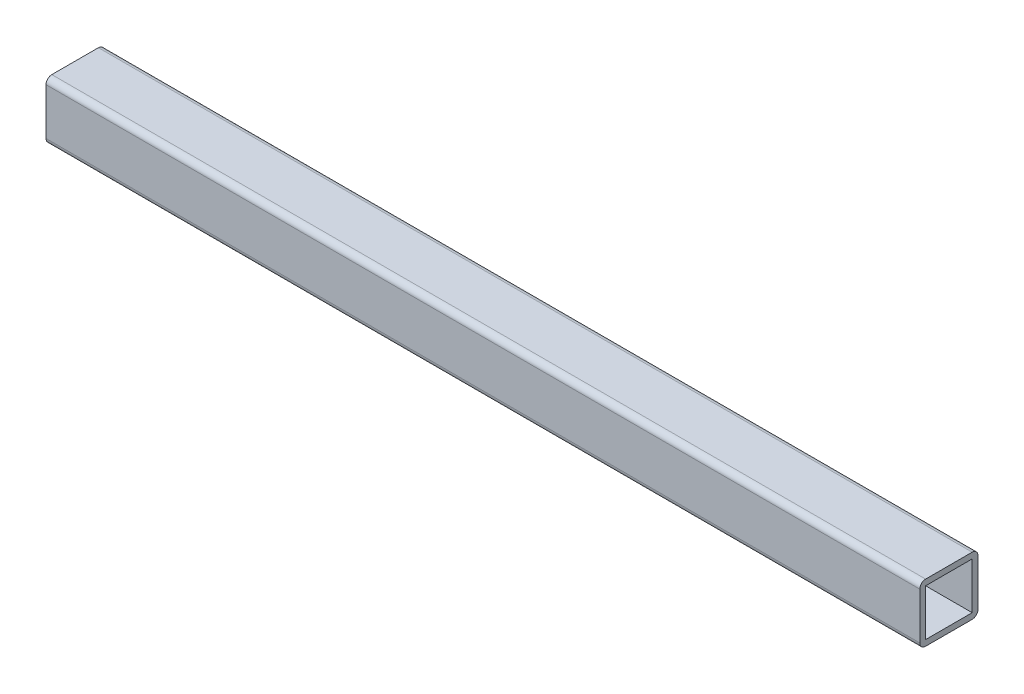
ISO-10303-21;
HEADER;
FILE_DESCRIPTION(('STEP AP214'),'2;1');
FILE_NAME('part.step','',(''),(''),'','','');
FILE_SCHEMA(('AUTOMOTIVE_DESIGN { 1 0 10303 214 1 1 1 1 }'));
ENDSEC;
DATA;
#1=APPLICATION_CONTEXT('core data for automotive mechanical design processes');
#2=APPLICATION_PROTOCOL_DEFINITION('international standard','automotive_design',2000,#1);
#3=PRODUCT_CONTEXT('',#1,'mechanical');
#4=PRODUCT('Part','Part','',(#3));
#5=PRODUCT_RELATED_PRODUCT_CATEGORY('part','',(#4));
#6=PRODUCT_DEFINITION_FORMATION('','',#4);
#7=PRODUCT_DEFINITION_CONTEXT('part definition',#1,'design');
#8=PRODUCT_DEFINITION('design','',#6,#7);
#9=PRODUCT_DEFINITION_SHAPE('','',#8);
#10=(LENGTH_UNIT() NAMED_UNIT(*) SI_UNIT(.MILLI.,.METRE.));
#11=(NAMED_UNIT(*) PLANE_ANGLE_UNIT() SI_UNIT($,.RADIAN.));
#12=(NAMED_UNIT(*) SI_UNIT($,.STERADIAN.) SOLID_ANGLE_UNIT());
#13=UNCERTAINTY_MEASURE_WITH_UNIT(LENGTH_MEASURE(1.E-05),#10,'distance_accuracy_value','');
#14=(GEOMETRIC_REPRESENTATION_CONTEXT(3) GLOBAL_UNCERTAINTY_ASSIGNED_CONTEXT((#13)) GLOBAL_UNIT_ASSIGNED_CONTEXT((#10,
#11,#12)) REPRESENTATION_CONTEXT('',''));
#15=CARTESIAN_POINT('',(0.,0.,0.));
#16=DIRECTION('',(0.,0.,1.));
#17=DIRECTION('',(1.,0.,0.));
#18=AXIS2_PLACEMENT_3D('',#15,#16,#17);
#19=CARTESIAN_POINT('',(-289.900000000001,-292.,-20.));
#20=DIRECTION('',(1.,0.,0.));
#21=DIRECTION('',(0.,0.,-1.));
#22=AXIS2_PLACEMENT_3D('',#19,#20,#21);
#23=PLANE('',#22);
#24=DIRECTION('',(0.,0.,1.));
#25=VECTOR('',#24,1.);
#26=CARTESIAN_POINT('',(-289.900000000001,-294.,-18.));
#27=LINE('',#26,#25);
#28=CARTESIAN_POINT('',(-289.900000000001,-294.,-18.));
#29=VERTEX_POINT('',#28);
#30=CARTESIAN_POINT('',(-289.900000000001,-294.,-2.));
#31=VERTEX_POINT('',#30);
#32=EDGE_CURVE('E60',#29,#31,#27,.T.);
#33=ORIENTED_EDGE('',*,*,#32,.F.);
#34=DIRECTION('',(0.,1.,0.));
#35=VECTOR('',#34,1.);
#36=CARTESIAN_POINT('',(-289.900000000001,-310.,-18.));
#37=LINE('',#36,#35);
#38=CARTESIAN_POINT('',(-289.900000000001,-310.,-18.));
#39=VERTEX_POINT('',#38);
#40=EDGE_CURVE('E155',#39,#29,#37,.T.);
#41=ORIENTED_EDGE('',*,*,#40,.F.);
#42=DIRECTION('',(0.,0.,-1.));
#43=VECTOR('',#42,1.);
#44=CARTESIAN_POINT('',(-289.900000000001,-310.,-2.));
#45=LINE('',#44,#43);
#46=CARTESIAN_POINT('',(-289.900000000001,-310.,-2.));
#47=VERTEX_POINT('',#46);
#48=EDGE_CURVE('E159',#47,#39,#45,.T.);
#49=ORIENTED_EDGE('',*,*,#48,.F.);
#50=DIRECTION('',(0.,-1.,0.));
#51=VECTOR('',#50,1.);
#52=CARTESIAN_POINT('',(-289.900000000001,-294.,-2.));
#53=LINE('',#52,#51);
#54=EDGE_CURVE('E168',#31,#47,#53,.T.);
#55=ORIENTED_EDGE('',*,*,#54,.F.);
#56=EDGE_LOOP('',(#33,#41,#49,#55));
#57=FACE_BOUND('',#56,.T.);
#58=DIRECTION('',(0.,1.,0.));
#59=VECTOR('',#58,1.);
#60=CARTESIAN_POINT('',(-289.900000000001,-292.,-20.));
#61=LINE('',#60,#59);
#62=CARTESIAN_POINT('',(-289.900000000001,-310.,-20.));
#63=VERTEX_POINT('',#62);
#64=CARTESIAN_POINT('',(-289.900000000001,-294.,-20.));
#65=VERTEX_POINT('',#64);
#66=EDGE_CURVE('E183',#63,#65,#61,.T.);
#67=ORIENTED_EDGE('',*,*,#66,.T.);
#68=CARTESIAN_POINT('',(-289.900000000001,-294.,-18.));
#69=DIRECTION('',(1.,0.,0.));
#70=DIRECTION('',(0.,0.,-1.));
#71=AXIS2_PLACEMENT_3D('',#68,#69,#70);
#72=CIRCLE('',#71,2.);
#73=CARTESIAN_POINT('',(-289.900000000001,-292.,-18.));
#74=VERTEX_POINT('',#73);
#75=EDGE_CURVE('E248',#65,#74,#72,.T.);
#76=ORIENTED_EDGE('',*,*,#75,.T.);
#77=DIRECTION('',(0.,0.,1.));
#78=VECTOR('',#77,1.);
#79=CARTESIAN_POINT('',(-289.900000000001,-292.,-20.));
#80=LINE('',#79,#78);
#81=CARTESIAN_POINT('',(-289.900000000001,-292.,-2.));
#82=VERTEX_POINT('',#81);
#83=EDGE_CURVE('E192',#74,#82,#80,.T.);
#84=ORIENTED_EDGE('',*,*,#83,.T.);
#85=CARTESIAN_POINT('',(-289.900000000001,-294.,-2.));
#86=DIRECTION('',(1.,0.,0.));
#87=DIRECTION('',(0.,0.,-1.));
#88=AXIS2_PLACEMENT_3D('',#85,#86,#87);
#89=CIRCLE('',#88,2.);
#90=CARTESIAN_POINT('',(-289.900000000001,-294.,0.));
#91=VERTEX_POINT('',#90);
#92=EDGE_CURVE('E242',#82,#91,#89,.T.);
#93=ORIENTED_EDGE('',*,*,#92,.T.);
#94=DIRECTION('',(0.,1.,0.));
#95=VECTOR('',#94,1.);
#96=CARTESIAN_POINT('',(-289.900000000001,-292.,0.));
#97=LINE('',#96,#95);
#98=CARTESIAN_POINT('',(-289.900000000001,-310.,0.));
#99=VERTEX_POINT('',#98);
#100=EDGE_CURVE('E177',#99,#91,#97,.T.);
#101=ORIENTED_EDGE('',*,*,#100,.F.);
#102=CARTESIAN_POINT('',(-289.900000000001,-310.,-2.));
#103=DIRECTION('',(1.,0.,0.));
#104=DIRECTION('',(0.,0.,-1.));
#105=AXIS2_PLACEMENT_3D('',#102,#103,#104);
#106=CIRCLE('',#105,2.);
#107=CARTESIAN_POINT('',(-289.900000000001,-312.,-2.));
#108=VERTEX_POINT('',#107);
#109=EDGE_CURVE('E239',#99,#108,#106,.T.);
#110=ORIENTED_EDGE('',*,*,#109,.T.);
#111=DIRECTION('',(0.,0.,1.));
#112=VECTOR('',#111,1.);
#113=CARTESIAN_POINT('',(-289.900000000001,-312.,-20.));
#114=LINE('',#113,#112);
#115=CARTESIAN_POINT('',(-289.900000000001,-312.,-18.));
#116=VERTEX_POINT('',#115);
#117=EDGE_CURVE('E199',#116,#108,#114,.T.);
#118=ORIENTED_EDGE('',*,*,#117,.F.);
#119=CARTESIAN_POINT('',(-289.900000000001,-310.,-18.));
#120=DIRECTION('',(1.,0.,0.));
#121=DIRECTION('',(0.,0.,-1.));
#122=AXIS2_PLACEMENT_3D('',#119,#120,#121);
#123=CIRCLE('',#122,2.);
#124=EDGE_CURVE('E245',#116,#63,#123,.T.);
#125=ORIENTED_EDGE('',*,*,#124,.T.);
#126=EDGE_LOOP('',(#67,#76,#84,#93,#101,#110,#118,#125));
#127=FACE_BOUND('',#126,.T.);
#128=ADVANCED_FACE('F44',(#57,#127),#23,.T.);
#129=CARTESIAN_POINT('',(-289.900000000001,-312.,-20.));
#130=DIRECTION('',(0.,-1.,0.));
#131=DIRECTION('',(0.,0.,-1.));
#132=AXIS2_PLACEMENT_3D('',#129,#130,#131);
#133=PLANE('',#132);
#134=DIRECTION('',(0.,0.,1.));
#135=VECTOR('',#134,1.);
#136=CARTESIAN_POINT('',(-590.1,-312.,-20.));
#137=LINE('',#136,#135);
#138=CARTESIAN_POINT('',(-590.1,-312.,-18.));
#139=VERTEX_POINT('',#138);
#140=CARTESIAN_POINT('',(-590.1,-312.,-2.));
#141=VERTEX_POINT('',#140);
#142=EDGE_CURVE('E204',#139,#141,#137,.T.);
#143=ORIENTED_EDGE('',*,*,#142,.F.);
#144=DIRECTION('',(1.,0.,0.));
#145=VECTOR('',#144,1.);
#146=CARTESIAN_POINT('',(-289.900000000001,-312.,-18.));
#147=LINE('',#146,#145);
#148=EDGE_CURVE('E254',#139,#116,#147,.T.);
#149=ORIENTED_EDGE('',*,*,#148,.T.);
#150=ORIENTED_EDGE('',*,*,#117,.T.);
#151=DIRECTION('',(1.,0.,0.));
#152=VECTOR('',#151,1.);
#153=CARTESIAN_POINT('',(-590.1,-312.,-2.));
#154=LINE('',#153,#152);
#155=EDGE_CURVE('E251',#108,#141,#154,.F.);
#156=ORIENTED_EDGE('',*,*,#155,.T.);
#157=EDGE_LOOP('',(#143,#149,#150,#156));
#158=FACE_BOUND('',#157,.T.);
#159=ADVANCED_FACE('F278',(#158),#133,.T.);
#160=CARTESIAN_POINT('',(-590.1,-292.,-20.));
#161=DIRECTION('',(-1.,0.,0.));
#162=DIRECTION('',(0.,0.,1.));
#163=AXIS2_PLACEMENT_3D('',#160,#161,#162);
#164=PLANE('',#163);
#165=DIRECTION('',(0.,0.,1.));
#166=VECTOR('',#165,1.);
#167=CARTESIAN_POINT('',(-590.1,-294.,-18.));
#168=LINE('',#167,#166);
#169=CARTESIAN_POINT('',(-590.1,-294.,-18.));
#170=VERTEX_POINT('',#169);
#171=CARTESIAN_POINT('',(-590.1,-294.,-2.));
#172=VERTEX_POINT('',#171);
#173=EDGE_CURVE('E136',#170,#172,#168,.T.);
#174=ORIENTED_EDGE('',*,*,#173,.T.);
#175=DIRECTION('',(0.,-1.,0.));
#176=VECTOR('',#175,1.);
#177=CARTESIAN_POINT('',(-590.1,-294.,-2.));
#178=LINE('',#177,#176);
#179=CARTESIAN_POINT('',(-590.1,-310.,-2.));
#180=VERTEX_POINT('',#179);
#181=EDGE_CURVE('E146',#172,#180,#178,.T.);
#182=ORIENTED_EDGE('',*,*,#181,.T.);
#183=DIRECTION('',(0.,0.,-1.));
#184=VECTOR('',#183,1.);
#185=CARTESIAN_POINT('',(-590.1,-310.,-2.));
#186=LINE('',#185,#184);
#187=CARTESIAN_POINT('',(-590.1,-310.,-18.));
#188=VERTEX_POINT('',#187);
#189=EDGE_CURVE('E68',#180,#188,#186,.T.);
#190=ORIENTED_EDGE('',*,*,#189,.T.);
#191=DIRECTION('',(0.,1.,0.));
#192=VECTOR('',#191,1.);
#193=CARTESIAN_POINT('',(-590.1,-310.,-18.));
#194=LINE('',#193,#192);
#195=EDGE_CURVE('E143',#188,#170,#194,.T.);
#196=ORIENTED_EDGE('',*,*,#195,.T.);
#197=EDGE_LOOP('',(#174,#182,#190,#196));
#198=FACE_BOUND('',#197,.T.);
#199=DIRECTION('',(0.,0.,1.));
#200=VECTOR('',#199,1.);
#201=CARTESIAN_POINT('',(-590.1,-292.,-20.));
#202=LINE('',#201,#200);
#203=CARTESIAN_POINT('',(-590.1,-292.,-18.));
#204=VERTEX_POINT('',#203);
#205=CARTESIAN_POINT('',(-590.1,-292.,-2.));
#206=VERTEX_POINT('',#205);
#207=EDGE_CURVE('E208',#204,#206,#202,.T.);
#208=ORIENTED_EDGE('',*,*,#207,.F.);
#209=CARTESIAN_POINT('',(-590.1,-294.,-18.));
#210=DIRECTION('',(-1.,0.,0.));
#211=DIRECTION('',(0.,0.,1.));
#212=AXIS2_PLACEMENT_3D('',#209,#210,#211);
#213=CIRCLE('',#212,2.);
#214=CARTESIAN_POINT('',(-590.1,-294.,-20.));
#215=VERTEX_POINT('',#214);
#216=EDGE_CURVE('E230',#204,#215,#213,.T.);
#217=ORIENTED_EDGE('',*,*,#216,.T.);
#218=DIRECTION('',(0.,-1.,0.));
#219=VECTOR('',#218,1.);
#220=CARTESIAN_POINT('',(-590.1,-292.,-20.));
#221=LINE('',#220,#219);
#222=CARTESIAN_POINT('',(-590.1,-310.,-20.));
#223=VERTEX_POINT('',#222);
#224=EDGE_CURVE('E187',#215,#223,#221,.T.);
#225=ORIENTED_EDGE('',*,*,#224,.T.);
#226=CARTESIAN_POINT('',(-590.1,-310.,-18.));
#227=DIRECTION('',(-1.,0.,0.));
#228=DIRECTION('',(0.,0.,1.));
#229=AXIS2_PLACEMENT_3D('',#226,#227,#228);
#230=CIRCLE('',#229,2.);
#231=EDGE_CURVE('E227',#223,#139,#230,.T.);
#232=ORIENTED_EDGE('',*,*,#231,.T.);
#233=ORIENTED_EDGE('',*,*,#142,.T.);
#234=CARTESIAN_POINT('',(-590.1,-310.,-2.));
#235=DIRECTION('',(-1.,0.,0.));
#236=DIRECTION('',(0.,0.,1.));
#237=AXIS2_PLACEMENT_3D('',#234,#235,#236);
#238=CIRCLE('',#237,2.);
#239=CARTESIAN_POINT('',(-590.1,-310.,0.));
#240=VERTEX_POINT('',#239);
#241=EDGE_CURVE('E221',#141,#240,#238,.T.);
#242=ORIENTED_EDGE('',*,*,#241,.T.);
#243=DIRECTION('',(0.,-1.,0.));
#244=VECTOR('',#243,1.);
#245=CARTESIAN_POINT('',(-590.1,-292.,0.));
#246=LINE('',#245,#244);
#247=CARTESIAN_POINT('',(-590.1,-294.,0.));
#248=VERTEX_POINT('',#247);
#249=EDGE_CURVE('E188',#248,#240,#246,.T.);
#250=ORIENTED_EDGE('',*,*,#249,.F.);
#251=CARTESIAN_POINT('',(-590.1,-294.,-2.));
#252=DIRECTION('',(-1.,0.,0.));
#253=DIRECTION('',(0.,0.,1.));
#254=AXIS2_PLACEMENT_3D('',#251,#252,#253);
#255=CIRCLE('',#254,2.);
#256=EDGE_CURVE('E224',#248,#206,#255,.T.);
#257=ORIENTED_EDGE('',*,*,#256,.T.);
#258=EDGE_LOOP('',(#208,#217,#225,#232,#233,#242,#250,#257));
#259=FACE_BOUND('',#258,.T.);
#260=ADVANCED_FACE('F151',(#198,#259),#164,.T.);
#261=CARTESIAN_POINT('',(-289.900000000001,-292.,-20.));
#262=DIRECTION('',(0.,1.,0.));
#263=DIRECTION('',(-1.,0.,0.));
#264=AXIS2_PLACEMENT_3D('',#261,#262,#263);
#265=PLANE('',#264);
#266=ORIENTED_EDGE('',*,*,#83,.F.);
#267=DIRECTION('',(-1.,0.,0.));
#268=VECTOR('',#267,1.);
#269=CARTESIAN_POINT('',(-289.900000000001,-292.,-18.));
#270=LINE('',#269,#268);
#271=EDGE_CURVE('E217',#74,#204,#270,.T.);
#272=ORIENTED_EDGE('',*,*,#271,.T.);
#273=ORIENTED_EDGE('',*,*,#207,.T.);
#274=DIRECTION('',(-1.,0.,0.));
#275=VECTOR('',#274,1.);
#276=CARTESIAN_POINT('',(-289.900000000001,-292.,-2.));
#277=LINE('',#276,#275);
#278=EDGE_CURVE('E203',#206,#82,#277,.F.);
#279=ORIENTED_EDGE('',*,*,#278,.T.);
#280=EDGE_LOOP('',(#266,#272,#273,#279));
#281=FACE_BOUND('',#280,.T.);
#282=ADVANCED_FACE('F294',(#281),#265,.T.);
#283=CARTESIAN_POINT('',(0.,0.,-20.));
#284=DIRECTION('',(0.,0.,-1.));
#285=DIRECTION('',(-1.,0.,0.));
#286=AXIS2_PLACEMENT_3D('',#283,#284,#285);
#287=PLANE('',#286);
#288=ORIENTED_EDGE('',*,*,#224,.F.);
#289=DIRECTION('',(-1.,0.,0.));
#290=VECTOR('',#289,1.);
#291=CARTESIAN_POINT('',(0.,-294.,-20.));
#292=LINE('',#291,#290);
#293=EDGE_CURVE('E236',#215,#65,#292,.F.);
#294=ORIENTED_EDGE('',*,*,#293,.T.);
#295=ORIENTED_EDGE('',*,*,#66,.F.);
#296=DIRECTION('',(1.,0.,0.));
#297=VECTOR('',#296,1.);
#298=CARTESIAN_POINT('',(0.,-310.,-20.));
#299=LINE('',#298,#297);
#300=EDGE_CURVE('E233',#63,#223,#299,.F.);
#301=ORIENTED_EDGE('',*,*,#300,.T.);
#302=EDGE_LOOP('',(#288,#294,#295,#301));
#303=FACE_BOUND('',#302,.T.);
#304=ADVANCED_FACE('F286',(#303),#287,.T.);
#305=CARTESIAN_POINT('',(0.,0.,0.));
#306=DIRECTION('',(0.,0.,-1.));
#307=DIRECTION('',(-1.,0.,0.));
#308=AXIS2_PLACEMENT_3D('',#305,#306,#307);
#309=PLANE('',#308);
#310=ORIENTED_EDGE('',*,*,#100,.T.);
#311=DIRECTION('',(-1.,0.,0.));
#312=VECTOR('',#311,1.);
#313=CARTESIAN_POINT('',(-590.1,-294.,0.));
#314=LINE('',#313,#312);
#315=EDGE_CURVE('E11',#91,#248,#314,.T.);
#316=ORIENTED_EDGE('',*,*,#315,.T.);
#317=ORIENTED_EDGE('',*,*,#249,.T.);
#318=DIRECTION('',(1.,0.,0.));
#319=VECTOR('',#318,1.);
#320=CARTESIAN_POINT('',(-289.900000000001,-310.,0.));
#321=LINE('',#320,#319);
#322=EDGE_CURVE('E53',#240,#99,#321,.T.);
#323=ORIENTED_EDGE('',*,*,#322,.T.);
#324=EDGE_LOOP('',(#310,#316,#317,#323));
#325=FACE_BOUND('',#324,.T.);
#326=ADVANCED_FACE('F262',(#325),#309,.F.);
#327=CARTESIAN_POINT('',(-289.900000000001,-294.,-18.));
#328=DIRECTION('',(-1.,0.,0.));
#329=DIRECTION('',(0.,-1.,0.));
#330=AXIS2_PLACEMENT_3D('',#327,#328,#329);
#331=CYLINDRICAL_SURFACE('',#330,2.);
#332=ORIENTED_EDGE('',*,*,#75,.F.);
#333=ORIENTED_EDGE('',*,*,#293,.F.);
#334=ORIENTED_EDGE('',*,*,#216,.F.);
#335=ORIENTED_EDGE('',*,*,#271,.F.);
#336=EDGE_LOOP('',(#332,#333,#334,#335));
#337=FACE_BOUND('',#336,.T.);
#338=ADVANCED_FACE('F291',(#337),#331,.T.);
#339=CARTESIAN_POINT('',(-289.900000000001,-310.,-18.));
#340=DIRECTION('',(1.,0.,0.));
#341=DIRECTION('',(0.,0.,-1.));
#342=AXIS2_PLACEMENT_3D('',#339,#340,#341);
#343=CYLINDRICAL_SURFACE('',#342,2.);
#344=ORIENTED_EDGE('',*,*,#231,.F.);
#345=ORIENTED_EDGE('',*,*,#300,.F.);
#346=ORIENTED_EDGE('',*,*,#124,.F.);
#347=ORIENTED_EDGE('',*,*,#148,.F.);
#348=EDGE_LOOP('',(#344,#345,#346,#347));
#349=FACE_BOUND('',#348,.T.);
#350=ADVANCED_FACE('F289',(#349),#343,.T.);
#351=CARTESIAN_POINT('',(0.,-294.,-2.));
#352=DIRECTION('',(1.,0.,0.));
#353=DIRECTION('',(0.,1.,0.));
#354=AXIS2_PLACEMENT_3D('',#351,#352,#353);
#355=CYLINDRICAL_SURFACE('',#354,2.);
#356=ORIENTED_EDGE('',*,*,#92,.F.);
#357=ORIENTED_EDGE('',*,*,#278,.F.);
#358=ORIENTED_EDGE('',*,*,#256,.F.);
#359=ORIENTED_EDGE('',*,*,#315,.F.);
#360=EDGE_LOOP('',(#356,#357,#358,#359));
#361=FACE_BOUND('',#360,.T.);
#362=ADVANCED_FACE('F273',(#361),#355,.T.);
#363=CARTESIAN_POINT('',(0.,-310.,-2.));
#364=DIRECTION('',(-1.,0.,0.));
#365=DIRECTION('',(0.,0.,1.));
#366=AXIS2_PLACEMENT_3D('',#363,#364,#365);
#367=CYLINDRICAL_SURFACE('',#366,2.);
#368=ORIENTED_EDGE('',*,*,#241,.F.);
#369=ORIENTED_EDGE('',*,*,#155,.F.);
#370=ORIENTED_EDGE('',*,*,#109,.F.);
#371=ORIENTED_EDGE('',*,*,#322,.F.);
#372=EDGE_LOOP('',(#368,#369,#370,#371));
#373=FACE_BOUND('',#372,.T.);
#374=ADVANCED_FACE('F46',(#373),#367,.T.);
#375=CARTESIAN_POINT('',(-590.1,-294.,-18.));
#376=DIRECTION('',(0.,1.,0.));
#377=DIRECTION('',(0.,0.,1.));
#378=AXIS2_PLACEMENT_3D('',#375,#376,#377);
#379=PLANE('',#378);
#380=ORIENTED_EDGE('',*,*,#32,.T.);
#381=DIRECTION('',(1.,0.,0.));
#382=VECTOR('',#381,1.);
#383=CARTESIAN_POINT('',(-590.1,-294.,-2.));
#384=LINE('',#383,#382);
#385=EDGE_CURVE('E132',#172,#31,#384,.T.);
#386=ORIENTED_EDGE('',*,*,#385,.F.);
#387=ORIENTED_EDGE('',*,*,#173,.F.);
#388=DIRECTION('',(1.,0.,0.));
#389=VECTOR('',#388,1.);
#390=CARTESIAN_POINT('',(-590.1,-294.,-18.));
#391=LINE('',#390,#389);
#392=EDGE_CURVE('E174',#170,#29,#391,.T.);
#393=ORIENTED_EDGE('',*,*,#392,.T.);
#394=EDGE_LOOP('',(#380,#386,#387,#393));
#395=FACE_BOUND('',#394,.T.);
#396=ADVANCED_FACE('F134',(#395),#379,.F.);
#397=CARTESIAN_POINT('',(-590.1,-310.,-18.));
#398=DIRECTION('',(0.,0.,-1.));
#399=DIRECTION('',(-1.,0.,0.));
#400=AXIS2_PLACEMENT_3D('',#397,#398,#399);
#401=PLANE('',#400);
#402=ORIENTED_EDGE('',*,*,#40,.T.);
#403=ORIENTED_EDGE('',*,*,#392,.F.);
#404=ORIENTED_EDGE('',*,*,#195,.F.);
#405=DIRECTION('',(1.,0.,0.));
#406=VECTOR('',#405,1.);
#407=CARTESIAN_POINT('',(-590.1,-310.,-18.));
#408=LINE('',#407,#406);
#409=EDGE_CURVE('E178',#188,#39,#408,.T.);
#410=ORIENTED_EDGE('',*,*,#409,.T.);
#411=EDGE_LOOP('',(#402,#403,#404,#410));
#412=FACE_BOUND('',#411,.T.);
#413=ADVANCED_FACE('F321',(#412),#401,.F.);
#414=CARTESIAN_POINT('',(-590.1,-310.,-2.));
#415=DIRECTION('',(0.,-1.,0.));
#416=DIRECTION('',(0.,0.,-1.));
#417=AXIS2_PLACEMENT_3D('',#414,#415,#416);
#418=PLANE('',#417);
#419=ORIENTED_EDGE('',*,*,#48,.T.);
#420=ORIENTED_EDGE('',*,*,#409,.F.);
#421=ORIENTED_EDGE('',*,*,#189,.F.);
#422=DIRECTION('',(1.,0.,0.));
#423=VECTOR('',#422,1.);
#424=CARTESIAN_POINT('',(-590.1,-310.,-2.));
#425=LINE('',#424,#423);
#426=EDGE_CURVE('E142',#180,#47,#425,.T.);
#427=ORIENTED_EDGE('',*,*,#426,.T.);
#428=EDGE_LOOP('',(#419,#420,#421,#427));
#429=FACE_BOUND('',#428,.T.);
#430=ADVANCED_FACE('F326',(#429),#418,.F.);
#431=CARTESIAN_POINT('',(-590.1,-294.,-2.));
#432=DIRECTION('',(0.,0.,1.));
#433=DIRECTION('',(1.,0.,0.));
#434=AXIS2_PLACEMENT_3D('',#431,#432,#433);
#435=PLANE('',#434);
#436=ORIENTED_EDGE('',*,*,#54,.T.);
#437=ORIENTED_EDGE('',*,*,#426,.F.);
#438=ORIENTED_EDGE('',*,*,#181,.F.);
#439=ORIENTED_EDGE('',*,*,#385,.T.);
#440=EDGE_LOOP('',(#436,#437,#438,#439));
#441=FACE_BOUND('',#440,.T.);
#442=ADVANCED_FACE('F147',(#441),#435,.F.);
#443=CLOSED_SHELL('',(#128,#159,#260,#282,#304,#326,#338,#350,#362,#374,#396,#413,#430,#442));
#444=MANIFOLD_SOLID_BREP('B2',#443);
#445=ADVANCED_BREP_SHAPE_REPRESENTATION('',(#18,#444),#14);
#446=SHAPE_DEFINITION_REPRESENTATION(#9,#445);
ENDSEC;
END-ISO-10303-21;
